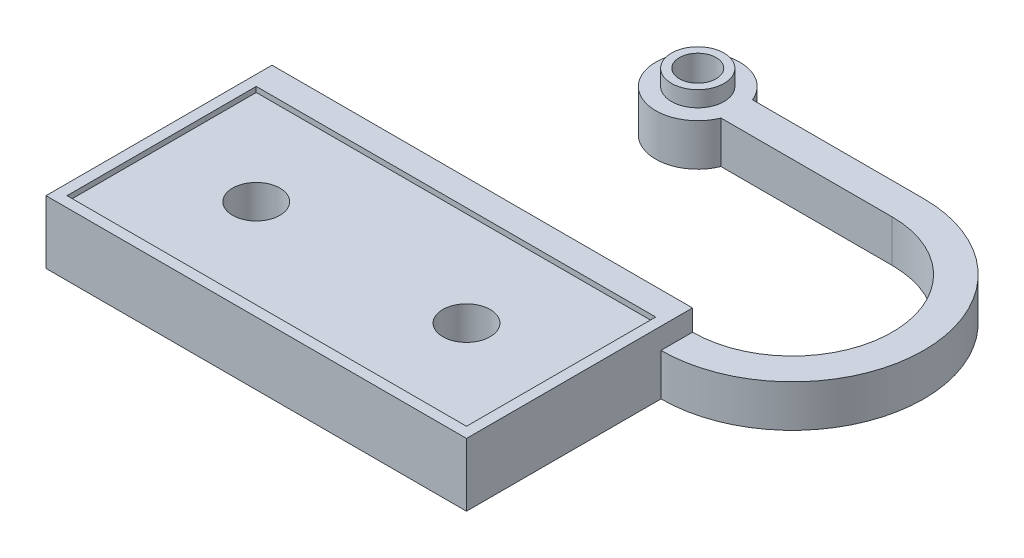
ISO-10303-21;
HEADER;
FILE_DESCRIPTION(('STEP AP214'),'2;1');
FILE_NAME('part.step','',(''),(''),'','','');
FILE_SCHEMA(('AUTOMOTIVE_DESIGN { 1 0 10303 214 1 1 1 1 }'));
ENDSEC;
DATA;
#1=APPLICATION_CONTEXT('core data for automotive mechanical design processes');
#2=APPLICATION_PROTOCOL_DEFINITION('international standard','automotive_design',2000,#1);
#3=PRODUCT_CONTEXT('',#1,'mechanical');
#4=PRODUCT('Part','Part','',(#3));
#5=PRODUCT_RELATED_PRODUCT_CATEGORY('part','',(#4));
#6=PRODUCT_DEFINITION_FORMATION('','',#4);
#7=PRODUCT_DEFINITION_CONTEXT('part definition',#1,'design');
#8=PRODUCT_DEFINITION('design','',#6,#7);
#9=PRODUCT_DEFINITION_SHAPE('','',#8);
#10=(LENGTH_UNIT() NAMED_UNIT(*) SI_UNIT(.MILLI.,.METRE.));
#11=(NAMED_UNIT(*) PLANE_ANGLE_UNIT() SI_UNIT($,.RADIAN.));
#12=(NAMED_UNIT(*) SI_UNIT($,.STERADIAN.) SOLID_ANGLE_UNIT());
#13=UNCERTAINTY_MEASURE_WITH_UNIT(LENGTH_MEASURE(1.E-05),#10,'distance_accuracy_value','');
#14=(GEOMETRIC_REPRESENTATION_CONTEXT(3) GLOBAL_UNCERTAINTY_ASSIGNED_CONTEXT((#13)) GLOBAL_UNIT_ASSIGNED_CONTEXT((#10,
#11,#12)) REPRESENTATION_CONTEXT('',''));
#15=CARTESIAN_POINT('',(0.,0.,0.));
#16=DIRECTION('',(0.,0.,1.));
#17=DIRECTION('',(1.,0.,0.));
#18=AXIS2_PLACEMENT_3D('',#15,#16,#17);
#19=CARTESIAN_POINT('',(-10.,6.,0.));
#20=DIRECTION('',(0.,-1.,0.));
#21=DIRECTION('',(0.,0.,-1.));
#22=AXIS2_PLACEMENT_3D('',#19,#20,#21);
#23=CYLINDRICAL_SURFACE('',#22,2.25);
#24=CARTESIAN_POINT('',(-10.,0.,0.));
#25=DIRECTION('',(0.,1.,0.));
#26=DIRECTION('',(0.,0.,1.));
#27=AXIS2_PLACEMENT_3D('',#24,#25,#26);
#28=CIRCLE('',#27,2.25);
#29=CARTESIAN_POINT('',(-10.,0.,2.25));
#30=VERTEX_POINT('',#29);
#31=EDGE_CURVE('E252',#30,#30,#28,.T.);
#32=ORIENTED_EDGE('',*,*,#31,.F.);
#33=EDGE_LOOP('',(#32));
#34=FACE_BOUND('',#33,.T.);
#35=CARTESIAN_POINT('',(-10.,5.5,0.));
#36=DIRECTION('',(0.,1.,0.));
#37=DIRECTION('',(0.,0.,1.));
#38=AXIS2_PLACEMENT_3D('',#35,#36,#37);
#39=CIRCLE('',#38,2.25);
#40=CARTESIAN_POINT('',(-10.,5.5,2.25));
#41=VERTEX_POINT('',#40);
#42=EDGE_CURVE('E173',#41,#41,#39,.T.);
#43=ORIENTED_EDGE('',*,*,#42,.T.);
#44=EDGE_LOOP('',(#43));
#45=FACE_BOUND('',#44,.T.);
#46=ADVANCED_FACE('F35',(#34,#45),#23,.F.);
#47=CARTESIAN_POINT('',(10.,6.,0.));
#48=DIRECTION('',(0.,-1.,0.));
#49=DIRECTION('',(0.,0.,-1.));
#50=AXIS2_PLACEMENT_3D('',#47,#48,#49);
#51=CYLINDRICAL_SURFACE('',#50,2.25);
#52=CARTESIAN_POINT('',(10.,0.,0.));
#53=DIRECTION('',(0.,1.,0.));
#54=DIRECTION('',(0.,0.,1.));
#55=AXIS2_PLACEMENT_3D('',#52,#53,#54);
#56=CIRCLE('',#55,2.25);
#57=CARTESIAN_POINT('',(10.,0.,2.25));
#58=VERTEX_POINT('',#57);
#59=EDGE_CURVE('E235',#58,#58,#56,.F.);
#60=ORIENTED_EDGE('',*,*,#59,.T.);
#61=EDGE_LOOP('',(#60));
#62=FACE_BOUND('',#61,.T.);
#63=CARTESIAN_POINT('',(10.,5.5,0.));
#64=DIRECTION('',(0.,1.,0.));
#65=DIRECTION('',(0.,0.,1.));
#66=AXIS2_PLACEMENT_3D('',#63,#64,#65);
#67=CIRCLE('',#66,2.25);
#68=CARTESIAN_POINT('',(10.,5.5,2.25));
#69=VERTEX_POINT('',#68);
#70=EDGE_CURVE('E39',#69,#69,#67,.F.);
#71=ORIENTED_EDGE('',*,*,#70,.F.);
#72=EDGE_LOOP('',(#71));
#73=FACE_BOUND('',#72,.T.);
#74=ADVANCED_FACE('F310',(#62,#73),#51,.F.);
#75=CARTESIAN_POINT('',(0.,4.,0.));
#76=DIRECTION('',(0.,1.,0.));
#77=DIRECTION('',(0.,0.,1.));
#78=AXIS2_PLACEMENT_3D('',#75,#76,#77);
#79=PLANE('',#78);
#80=CARTESIAN_POINT('',(20.,4.,-21.));
#81=DIRECTION('',(0.,1.,0.));
#82=DIRECTION('',(0.,0.,1.));
#83=AXIS2_PLACEMENT_3D('',#80,#81,#82);
#84=CIRCLE('',#83,12.5);
#85=CARTESIAN_POINT('',(20.,4.,-33.5));
#86=VERTEX_POINT('',#85);
#87=CARTESIAN_POINT('',(20.,4.,-8.5));
#88=VERTEX_POINT('',#87);
#89=EDGE_CURVE('E185',#86,#88,#84,.F.);
#90=ORIENTED_EDGE('',*,*,#89,.F.);
#91=DIRECTION('',(1.,0.,0.));
#92=VECTOR('',#91,1.);
#93=CARTESIAN_POINT('',(0.,4.,-33.5));
#94=LINE('',#93,#92);
#95=CARTESIAN_POINT('',(3.70809924354784,4.,-33.5));
#96=VERTEX_POINT('',#95);
#97=EDGE_CURVE('E188',#96,#86,#94,.T.);
#98=ORIENTED_EDGE('',*,*,#97,.F.);
#99=CARTESIAN_POINT('',(0.,4.,-32.));
#100=DIRECTION('',(0.,1.,0.));
#101=DIRECTION('',(0.,0.,1.));
#102=AXIS2_PLACEMENT_3D('',#99,#100,#101);
#103=CIRCLE('',#102,4.);
#104=CARTESIAN_POINT('',(3.70809924354783,4.,-30.5));
#105=VERTEX_POINT('',#104);
#106=EDGE_CURVE('E192',#105,#96,#103,.F.);
#107=ORIENTED_EDGE('',*,*,#106,.F.);
#108=DIRECTION('',(-1.,0.,0.));
#109=VECTOR('',#108,1.);
#110=CARTESIAN_POINT('',(0.,4.,-30.5));
#111=LINE('',#110,#109);
#112=CARTESIAN_POINT('',(20.,4.,-30.5));
#113=VERTEX_POINT('',#112);
#114=EDGE_CURVE('E195',#113,#105,#111,.T.);
#115=ORIENTED_EDGE('',*,*,#114,.F.);
#116=CARTESIAN_POINT('',(20.,4.,-21.));
#117=DIRECTION('',(0.,1.,0.));
#118=DIRECTION('',(0.,0.,1.));
#119=AXIS2_PLACEMENT_3D('',#116,#117,#118);
#120=CIRCLE('',#119,9.49999999999999);
#121=CARTESIAN_POINT('',(20.,4.,-11.5));
#122=VERTEX_POINT('',#121);
#123=EDGE_CURVE('E198',#122,#113,#120,.T.);
#124=ORIENTED_EDGE('',*,*,#123,.F.);
#125=DIRECTION('',(0.,0.,1.));
#126=VECTOR('',#125,1.);
#127=CARTESIAN_POINT('',(20.,4.,0.));
#128=LINE('',#127,#126);
#129=EDGE_CURVE('E201',#122,#88,#128,.T.);
#130=ORIENTED_EDGE('',*,*,#129,.T.);
#131=EDGE_LOOP('',(#90,#98,#107,#115,#124,#130));
#132=FACE_BOUND('',#131,.T.);
#133=CARTESIAN_POINT('',(0.,4.,-32.));
#134=DIRECTION('',(0.,1.,0.));
#135=DIRECTION('',(0.,0.,1.));
#136=AXIS2_PLACEMENT_3D('',#133,#134,#135);
#137=CIRCLE('',#136,2.5);
#138=CARTESIAN_POINT('',(0.,4.,-29.5));
#139=VERTEX_POINT('',#138);
#140=EDGE_CURVE('E179',#139,#139,#137,.T.);
#141=ORIENTED_EDGE('',*,*,#140,.F.);
#142=EDGE_LOOP('',(#141));
#143=FACE_BOUND('',#142,.T.);
#144=ADVANCED_FACE('F281',(#132,#143),#79,.T.);
#145=CARTESIAN_POINT('',(20.,6.,0.));
#146=DIRECTION('',(1.,0.,0.));
#147=DIRECTION('',(0.,0.,-1.));
#148=AXIS2_PLACEMENT_3D('',#145,#146,#147);
#149=PLANE('',#148);
#150=DIRECTION('',(0.,-1.,0.));
#151=VECTOR('',#150,1.);
#152=CARTESIAN_POINT('',(20.,4.,-8.5));
#153=LINE('',#152,#151);
#154=CARTESIAN_POINT('',(20.,0.,-8.5));
#155=VERTEX_POINT('',#154);
#156=EDGE_CURVE('E203',#88,#155,#153,.T.);
#157=ORIENTED_EDGE('',*,*,#156,.F.);
#158=ORIENTED_EDGE('',*,*,#129,.F.);
#159=DIRECTION('',(0.,-1.,0.));
#160=VECTOR('',#159,1.);
#161=CARTESIAN_POINT('',(20.,6.,-11.5));
#162=LINE('',#161,#160);
#163=CARTESIAN_POINT('',(20.,6.,-11.5));
#164=VERTEX_POINT('',#163);
#165=EDGE_CURVE('E11',#164,#122,#162,.T.);
#166=ORIENTED_EDGE('',*,*,#165,.F.);
#167=DIRECTION('',(0.,0.,1.));
#168=VECTOR('',#167,1.);
#169=CARTESIAN_POINT('',(20.,6.,0.));
#170=LINE('',#169,#168);
#171=CARTESIAN_POINT('',(20.,6.,10.));
#172=VERTEX_POINT('',#171);
#173=EDGE_CURVE('E231',#164,#172,#170,.T.);
#174=ORIENTED_EDGE('',*,*,#173,.T.);
#175=DIRECTION('',(0.,-1.,0.));
#176=VECTOR('',#175,1.);
#177=CARTESIAN_POINT('',(20.,6.,10.));
#178=LINE('',#177,#176);
#179=CARTESIAN_POINT('',(20.,0.,10.));
#180=VERTEX_POINT('',#179);
#181=EDGE_CURVE('E242',#172,#180,#178,.T.);
#182=ORIENTED_EDGE('',*,*,#181,.T.);
#183=DIRECTION('',(0.,0.,1.));
#184=VECTOR('',#183,1.);
#185=CARTESIAN_POINT('',(20.,0.,0.));
#186=LINE('',#185,#184);
#187=EDGE_CURVE('E230',#155,#180,#186,.T.);
#188=ORIENTED_EDGE('',*,*,#187,.F.);
#189=EDGE_LOOP('',(#157,#158,#166,#174,#182,#188));
#190=FACE_BOUND('',#189,.T.);
#191=ADVANCED_FACE('F37',(#190),#149,.T.);
#192=CARTESIAN_POINT('',(0.,6.,-11.5));
#193=DIRECTION('',(0.,0.,-1.));
#194=DIRECTION('',(-1.,0.,0.));
#195=AXIS2_PLACEMENT_3D('',#192,#193,#194);
#196=PLANE('',#195);
#197=DIRECTION('',(1.,0.,0.));
#198=VECTOR('',#197,1.);
#199=CARTESIAN_POINT('',(0.,0.,-11.5));
#200=LINE('',#199,#198);
#201=CARTESIAN_POINT('',(-19.9999999999999,0.,-11.5));
#202=VERTEX_POINT('',#201);
#203=CARTESIAN_POINT('',(20.,0.,-11.5));
#204=VERTEX_POINT('',#203);
#205=EDGE_CURVE('E244',#202,#204,#200,.T.);
#206=ORIENTED_EDGE('',*,*,#205,.F.);
#207=DIRECTION('',(0.,-1.,0.));
#208=VECTOR('',#207,1.);
#209=CARTESIAN_POINT('',(-19.9999999999999,6.,-11.5));
#210=LINE('',#209,#208);
#211=CARTESIAN_POINT('',(-19.9999999999999,6.,-11.5));
#212=VERTEX_POINT('',#211);
#213=EDGE_CURVE('E44',#212,#202,#210,.T.);
#214=ORIENTED_EDGE('',*,*,#213,.F.);
#215=DIRECTION('',(1.,0.,0.));
#216=VECTOR('',#215,1.);
#217=CARTESIAN_POINT('',(0.,6.,-11.5));
#218=LINE('',#217,#216);
#219=EDGE_CURVE('E234',#212,#164,#218,.T.);
#220=ORIENTED_EDGE('',*,*,#219,.T.);
#221=ORIENTED_EDGE('',*,*,#165,.T.);
#222=DIRECTION('',(0.,-1.,0.));
#223=VECTOR('',#222,1.);
#224=CARTESIAN_POINT('',(20.,4.,-11.5));
#225=LINE('',#224,#223);
#226=EDGE_CURVE('E219',#122,#204,#225,.T.);
#227=ORIENTED_EDGE('',*,*,#226,.T.);
#228=EDGE_LOOP('',(#206,#214,#220,#221,#227));
#229=FACE_BOUND('',#228,.T.);
#230=ADVANCED_FACE('F273',(#229),#196,.T.);
#231=CARTESIAN_POINT('',(-20.0000000000001,6.,2.98372437868013E-13));
#232=DIRECTION('',(1.,0.,0.));
#233=DIRECTION('',(0.,0.,-1.));
#234=AXIS2_PLACEMENT_3D('',#231,#232,#233);
#235=PLANE('',#234);
#236=DIRECTION('',(0.,0.,1.));
#237=VECTOR('',#236,1.);
#238=CARTESIAN_POINT('',(-20.0000000000001,0.,2.98372437868013E-13));
#239=LINE('',#238,#237);
#240=CARTESIAN_POINT('',(-20.,0.,10.));
#241=VERTEX_POINT('',#240);
#242=EDGE_CURVE('E247',#202,#241,#239,.T.);
#243=ORIENTED_EDGE('',*,*,#242,.T.);
#244=DIRECTION('',(0.,-1.,0.));
#245=VECTOR('',#244,1.);
#246=CARTESIAN_POINT('',(-20.,6.,10.));
#247=LINE('',#246,#245);
#248=CARTESIAN_POINT('',(-20.,6.,10.));
#249=VERTEX_POINT('',#248);
#250=EDGE_CURVE('E259',#249,#241,#247,.T.);
#251=ORIENTED_EDGE('',*,*,#250,.F.);
#252=DIRECTION('',(0.,0.,1.));
#253=VECTOR('',#252,1.);
#254=CARTESIAN_POINT('',(-20.0000000000001,6.,2.98372437868013E-13));
#255=LINE('',#254,#253);
#256=EDGE_CURVE('E238',#212,#249,#255,.T.);
#257=ORIENTED_EDGE('',*,*,#256,.F.);
#258=ORIENTED_EDGE('',*,*,#213,.T.);
#259=EDGE_LOOP('',(#243,#251,#257,#258));
#260=FACE_BOUND('',#259,.T.);
#261=ADVANCED_FACE('F265',(#260),#235,.F.);
#262=CARTESIAN_POINT('',(0.,6.,10.));
#263=DIRECTION('',(0.,0.,-1.));
#264=DIRECTION('',(-1.,0.,0.));
#265=AXIS2_PLACEMENT_3D('',#262,#263,#264);
#266=PLANE('',#265);
#267=DIRECTION('',(1.,0.,0.));
#268=VECTOR('',#267,1.);
#269=CARTESIAN_POINT('',(0.,0.,10.));
#270=LINE('',#269,#268);
#271=EDGE_CURVE('E249',#241,#180,#270,.T.);
#272=ORIENTED_EDGE('',*,*,#271,.T.);
#273=ORIENTED_EDGE('',*,*,#181,.F.);
#274=DIRECTION('',(1.,0.,0.));
#275=VECTOR('',#274,1.);
#276=CARTESIAN_POINT('',(0.,6.,10.));
#277=LINE('',#276,#275);
#278=EDGE_CURVE('E240',#249,#172,#277,.T.);
#279=ORIENTED_EDGE('',*,*,#278,.F.);
#280=ORIENTED_EDGE('',*,*,#250,.T.);
#281=EDGE_LOOP('',(#272,#273,#279,#280));
#282=FACE_BOUND('',#281,.T.);
#283=ADVANCED_FACE('F322',(#282),#266,.F.);
#284=CARTESIAN_POINT('',(0.,6.,0.));
#285=DIRECTION('',(0.,1.,0.));
#286=DIRECTION('',(0.,0.,1.));
#287=AXIS2_PLACEMENT_3D('',#284,#285,#286);
#288=PLANE('',#287);
#289=DIRECTION('',(0.,0.,1.));
#290=VECTOR('',#289,1.);
#291=CARTESIAN_POINT('',(-19.,6.,-9.));
#292=LINE('',#291,#290);
#293=CARTESIAN_POINT('',(-19.,6.,-9.));
#294=VERTEX_POINT('',#293);
#295=CARTESIAN_POINT('',(-19.,6.,9.));
#296=VERTEX_POINT('',#295);
#297=EDGE_CURVE('E51',#294,#296,#292,.T.);
#298=ORIENTED_EDGE('',*,*,#297,.F.);
#299=DIRECTION('',(1.,0.,0.));
#300=VECTOR('',#299,1.);
#301=CARTESIAN_POINT('',(-19.,6.,-9.));
#302=LINE('',#301,#300);
#303=CARTESIAN_POINT('',(19.,6.,-9.));
#304=VERTEX_POINT('',#303);
#305=EDGE_CURVE('E155',#294,#304,#302,.T.);
#306=ORIENTED_EDGE('',*,*,#305,.T.);
#307=DIRECTION('',(0.,0.,1.));
#308=VECTOR('',#307,1.);
#309=CARTESIAN_POINT('',(19.,6.,-9.));
#310=LINE('',#309,#308);
#311=CARTESIAN_POINT('',(19.,6.,9.));
#312=VERTEX_POINT('',#311);
#313=EDGE_CURVE('E158',#304,#312,#310,.T.);
#314=ORIENTED_EDGE('',*,*,#313,.T.);
#315=DIRECTION('',(1.,0.,0.));
#316=VECTOR('',#315,1.);
#317=CARTESIAN_POINT('',(-19.,6.,9.));
#318=LINE('',#317,#316);
#319=EDGE_CURVE('E164',#296,#312,#318,.T.);
#320=ORIENTED_EDGE('',*,*,#319,.F.);
#321=EDGE_LOOP('',(#298,#306,#314,#320));
#322=FACE_BOUND('',#321,.T.);
#323=ORIENTED_EDGE('',*,*,#173,.F.);
#324=ORIENTED_EDGE('',*,*,#219,.F.);
#325=ORIENTED_EDGE('',*,*,#256,.T.);
#326=ORIENTED_EDGE('',*,*,#278,.T.);
#327=EDGE_LOOP('',(#323,#324,#325,#326));
#328=FACE_BOUND('',#327,.T.);
#329=ADVANCED_FACE('F325',(#322,#328),#288,.T.);
#330=CARTESIAN_POINT('',(0.,0.,0.));
#331=DIRECTION('',(0.,1.,0.));
#332=DIRECTION('',(0.,0.,1.));
#333=AXIS2_PLACEMENT_3D('',#330,#331,#332);
#334=PLANE('',#333);
#335=ORIENTED_EDGE('',*,*,#205,.T.);
#336=CARTESIAN_POINT('',(20.,0.,-21.));
#337=DIRECTION('',(0.,1.,0.));
#338=DIRECTION('',(0.,0.,1.));
#339=AXIS2_PLACEMENT_3D('',#336,#337,#338);
#340=CIRCLE('',#339,9.49999999999999);
#341=CARTESIAN_POINT('',(20.,0.,-30.5));
#342=VERTEX_POINT('',#341);
#343=EDGE_CURVE('E213',#204,#342,#340,.T.);
#344=ORIENTED_EDGE('',*,*,#343,.T.);
#345=DIRECTION('',(-1.,0.,0.));
#346=VECTOR('',#345,1.);
#347=CARTESIAN_POINT('',(0.,0.,-30.5));
#348=LINE('',#347,#346);
#349=CARTESIAN_POINT('',(3.70809924354783,0.,-30.5));
#350=VERTEX_POINT('',#349);
#351=EDGE_CURVE('E210',#342,#350,#348,.T.);
#352=ORIENTED_EDGE('',*,*,#351,.T.);
#353=CARTESIAN_POINT('',(0.,0.,-32.));
#354=DIRECTION('',(0.,1.,0.));
#355=DIRECTION('',(0.,0.,1.));
#356=AXIS2_PLACEMENT_3D('',#353,#354,#355);
#357=CIRCLE('',#356,4.);
#358=CARTESIAN_POINT('',(3.70809924354784,0.,-33.5));
#359=VERTEX_POINT('',#358);
#360=EDGE_CURVE('E207',#350,#359,#357,.F.);
#361=ORIENTED_EDGE('',*,*,#360,.T.);
#362=DIRECTION('',(1.,0.,0.));
#363=VECTOR('',#362,1.);
#364=CARTESIAN_POINT('',(0.,0.,-33.5));
#365=LINE('',#364,#363);
#366=CARTESIAN_POINT('',(20.,0.,-33.5));
#367=VERTEX_POINT('',#366);
#368=EDGE_CURVE('E205',#359,#367,#365,.T.);
#369=ORIENTED_EDGE('',*,*,#368,.T.);
#370=CARTESIAN_POINT('',(20.,0.,-21.));
#371=DIRECTION('',(0.,1.,0.));
#372=DIRECTION('',(0.,0.,1.));
#373=AXIS2_PLACEMENT_3D('',#370,#371,#372);
#374=CIRCLE('',#373,12.5);
#375=EDGE_CURVE('E59',#367,#155,#374,.F.);
#376=ORIENTED_EDGE('',*,*,#375,.T.);
#377=ORIENTED_EDGE('',*,*,#187,.T.);
#378=ORIENTED_EDGE('',*,*,#271,.F.);
#379=ORIENTED_EDGE('',*,*,#242,.F.);
#380=EDGE_LOOP('',(#335,#344,#352,#361,#369,#376,#377,#378,#379));
#381=FACE_BOUND('',#380,.T.);
#382=ORIENTED_EDGE('',*,*,#31,.T.);
#383=EDGE_LOOP('',(#382));
#384=FACE_BOUND('',#383,.T.);
#385=ORIENTED_EDGE('',*,*,#59,.F.);
#386=EDGE_LOOP('',(#385));
#387=FACE_BOUND('',#386,.T.);
#388=CARTESIAN_POINT('',(0.,0.,-32.));
#389=DIRECTION('',(0.,1.,0.));
#390=DIRECTION('',(0.,0.,1.));
#391=AXIS2_PLACEMENT_3D('',#388,#389,#390);
#392=CIRCLE('',#391,1.75);
#393=CARTESIAN_POINT('',(0.,0.,-30.25));
#394=VERTEX_POINT('',#393);
#395=EDGE_CURVE('E189',#394,#394,#392,.T.);
#396=ORIENTED_EDGE('',*,*,#395,.T.);
#397=EDGE_LOOP('',(#396));
#398=FACE_BOUND('',#397,.T.);
#399=ADVANCED_FACE('F271',(#381,#384,#387,#398),#334,.F.);
#400=CARTESIAN_POINT('',(20.,4.,-21.));
#401=DIRECTION('',(0.,-1.,0.));
#402=DIRECTION('',(0.,0.,-1.));
#403=AXIS2_PLACEMENT_3D('',#400,#401,#402);
#404=CYLINDRICAL_SURFACE('',#403,12.5);
#405=ORIENTED_EDGE('',*,*,#375,.F.);
#406=DIRECTION('',(0.,-1.,0.));
#407=VECTOR('',#406,1.);
#408=CARTESIAN_POINT('',(20.,4.,-33.5));
#409=LINE('',#408,#407);
#410=EDGE_CURVE('E228',#86,#367,#409,.T.);
#411=ORIENTED_EDGE('',*,*,#410,.F.);
#412=ORIENTED_EDGE('',*,*,#89,.T.);
#413=ORIENTED_EDGE('',*,*,#156,.T.);
#414=EDGE_LOOP('',(#405,#411,#412,#413));
#415=FACE_BOUND('',#414,.T.);
#416=ADVANCED_FACE('F289',(#415),#404,.T.);
#417=CARTESIAN_POINT('',(0.,4.,-33.5));
#418=DIRECTION('',(0.,0.,-1.));
#419=DIRECTION('',(-1.,0.,0.));
#420=AXIS2_PLACEMENT_3D('',#417,#418,#419);
#421=PLANE('',#420);
#422=ORIENTED_EDGE('',*,*,#368,.F.);
#423=DIRECTION('',(0.,-1.,0.));
#424=VECTOR('',#423,1.);
#425=CARTESIAN_POINT('',(3.70809924354784,4.,-33.5));
#426=LINE('',#425,#424);
#427=EDGE_CURVE('E226',#96,#359,#426,.T.);
#428=ORIENTED_EDGE('',*,*,#427,.F.);
#429=ORIENTED_EDGE('',*,*,#97,.T.);
#430=ORIENTED_EDGE('',*,*,#410,.T.);
#431=EDGE_LOOP('',(#422,#428,#429,#430));
#432=FACE_BOUND('',#431,.T.);
#433=ADVANCED_FACE('F293',(#432),#421,.T.);
#434=CARTESIAN_POINT('',(0.,4.,-32.));
#435=DIRECTION('',(0.,-1.,0.));
#436=DIRECTION('',(0.,0.,-1.));
#437=AXIS2_PLACEMENT_3D('',#434,#435,#436);
#438=CYLINDRICAL_SURFACE('',#437,4.);
#439=ORIENTED_EDGE('',*,*,#360,.F.);
#440=DIRECTION('',(0.,-1.,0.));
#441=VECTOR('',#440,1.);
#442=CARTESIAN_POINT('',(3.70809924354783,4.,-30.5));
#443=LINE('',#442,#441);
#444=EDGE_CURVE('E224',#105,#350,#443,.T.);
#445=ORIENTED_EDGE('',*,*,#444,.F.);
#446=ORIENTED_EDGE('',*,*,#106,.T.);
#447=ORIENTED_EDGE('',*,*,#427,.T.);
#448=EDGE_LOOP('',(#439,#445,#446,#447));
#449=FACE_BOUND('',#448,.T.);
#450=ADVANCED_FACE('F296',(#449),#438,.T.);
#451=CARTESIAN_POINT('',(0.,4.,-30.5));
#452=DIRECTION('',(0.,0.,1.));
#453=DIRECTION('',(1.,0.,0.));
#454=AXIS2_PLACEMENT_3D('',#451,#452,#453);
#455=PLANE('',#454);
#456=ORIENTED_EDGE('',*,*,#351,.F.);
#457=DIRECTION('',(0.,-1.,0.));
#458=VECTOR('',#457,1.);
#459=CARTESIAN_POINT('',(20.,4.,-30.5));
#460=LINE('',#459,#458);
#461=EDGE_CURVE('E222',#113,#342,#460,.T.);
#462=ORIENTED_EDGE('',*,*,#461,.F.);
#463=ORIENTED_EDGE('',*,*,#114,.T.);
#464=ORIENTED_EDGE('',*,*,#444,.T.);
#465=EDGE_LOOP('',(#456,#462,#463,#464));
#466=FACE_BOUND('',#465,.T.);
#467=ADVANCED_FACE('F299',(#466),#455,.T.);
#468=CARTESIAN_POINT('',(20.,4.,-21.));
#469=DIRECTION('',(0.,-1.,0.));
#470=DIRECTION('',(0.,0.,-1.));
#471=AXIS2_PLACEMENT_3D('',#468,#469,#470);
#472=CYLINDRICAL_SURFACE('',#471,9.49999999999999);
#473=ORIENTED_EDGE('',*,*,#343,.F.);
#474=ORIENTED_EDGE('',*,*,#226,.F.);
#475=ORIENTED_EDGE('',*,*,#123,.T.);
#476=ORIENTED_EDGE('',*,*,#461,.T.);
#477=EDGE_LOOP('',(#473,#474,#475,#476));
#478=FACE_BOUND('',#477,.T.);
#479=ADVANCED_FACE('F276',(#478),#472,.F.);
#480=CARTESIAN_POINT('',(0.,4.,-32.));
#481=DIRECTION('',(0.,-1.,0.));
#482=DIRECTION('',(0.,0.,-1.));
#483=AXIS2_PLACEMENT_3D('',#480,#481,#482);
#484=CYLINDRICAL_SURFACE('',#483,1.75);
#485=ORIENTED_EDGE('',*,*,#395,.F.);
#486=EDGE_LOOP('',(#485));
#487=FACE_BOUND('',#486,.T.);
#488=CARTESIAN_POINT('',(0.,5.5,-32.));
#489=DIRECTION('',(0.,1.,0.));
#490=DIRECTION('',(0.,0.,1.));
#491=AXIS2_PLACEMENT_3D('',#488,#489,#490);
#492=CIRCLE('',#491,1.75);
#493=CARTESIAN_POINT('',(0.,5.5,-30.25));
#494=VERTEX_POINT('',#493);
#495=EDGE_CURVE('E176',#494,#494,#492,.T.);
#496=ORIENTED_EDGE('',*,*,#495,.T.);
#497=EDGE_LOOP('',(#496));
#498=FACE_BOUND('',#497,.T.);
#499=ADVANCED_FACE('F306',(#487,#498),#484,.F.);
#500=CARTESIAN_POINT('',(0.,5.5,-32.));
#501=DIRECTION('',(0.,1.,0.));
#502=DIRECTION('',(0.,0.,1.));
#503=AXIS2_PLACEMENT_3D('',#500,#501,#502);
#504=PLANE('',#503);
#505=CARTESIAN_POINT('',(0.,5.5,-32.));
#506=DIRECTION('',(0.,1.,0.));
#507=DIRECTION('',(0.,0.,1.));
#508=AXIS2_PLACEMENT_3D('',#505,#506,#507);
#509=CIRCLE('',#508,2.5);
#510=CARTESIAN_POINT('',(0.,5.5,-29.5));
#511=VERTEX_POINT('',#510);
#512=EDGE_CURVE('E180',#511,#511,#509,.T.);
#513=ORIENTED_EDGE('',*,*,#512,.T.);
#514=EDGE_LOOP('',(#513));
#515=FACE_BOUND('',#514,.T.);
#516=ORIENTED_EDGE('',*,*,#495,.F.);
#517=EDGE_LOOP('',(#516));
#518=FACE_BOUND('',#517,.T.);
#519=ADVANCED_FACE('F343',(#515,#518),#504,.T.);
#520=CARTESIAN_POINT('',(0.,5.5,-32.));
#521=DIRECTION('',(0.,-1.,0.));
#522=DIRECTION('',(0.,0.,-1.));
#523=AXIS2_PLACEMENT_3D('',#520,#521,#522);
#524=CYLINDRICAL_SURFACE('',#523,2.5);
#525=ORIENTED_EDGE('',*,*,#512,.F.);
#526=EDGE_LOOP('',(#525));
#527=FACE_BOUND('',#526,.T.);
#528=ORIENTED_EDGE('',*,*,#140,.T.);
#529=EDGE_LOOP('',(#528));
#530=FACE_BOUND('',#529,.T.);
#531=ADVANCED_FACE('F340',(#527,#530),#524,.T.);
#532=CARTESIAN_POINT('',(0.,5.5,0.));
#533=DIRECTION('',(0.,1.,0.));
#534=DIRECTION('',(0.,0.,1.));
#535=AXIS2_PLACEMENT_3D('',#532,#533,#534);
#536=PLANE('',#535);
#537=ORIENTED_EDGE('',*,*,#42,.F.);
#538=EDGE_LOOP('',(#537));
#539=FACE_BOUND('',#538,.T.);
#540=DIRECTION('',(0.,0.,1.));
#541=VECTOR('',#540,1.);
#542=CARTESIAN_POINT('',(-19.,5.5,-9.));
#543=LINE('',#542,#541);
#544=CARTESIAN_POINT('',(-19.,5.5,-9.));
#545=VERTEX_POINT('',#544);
#546=CARTESIAN_POINT('',(-19.,5.5,9.));
#547=VERTEX_POINT('',#546);
#548=EDGE_CURVE('E137',#545,#547,#543,.T.);
#549=ORIENTED_EDGE('',*,*,#548,.T.);
#550=DIRECTION('',(1.,0.,0.));
#551=VECTOR('',#550,1.);
#552=CARTESIAN_POINT('',(-19.,5.5,9.));
#553=LINE('',#552,#551);
#554=CARTESIAN_POINT('',(19.,5.5,9.));
#555=VERTEX_POINT('',#554);
#556=EDGE_CURVE('E146',#547,#555,#553,.T.);
#557=ORIENTED_EDGE('',*,*,#556,.T.);
#558=DIRECTION('',(0.,0.,1.));
#559=VECTOR('',#558,1.);
#560=CARTESIAN_POINT('',(19.,5.5,-9.));
#561=LINE('',#560,#559);
#562=CARTESIAN_POINT('',(19.,5.5,-9.));
#563=VERTEX_POINT('',#562);
#564=EDGE_CURVE('E150',#563,#555,#561,.T.);
#565=ORIENTED_EDGE('',*,*,#564,.F.);
#566=DIRECTION('',(1.,0.,0.));
#567=VECTOR('',#566,1.);
#568=CARTESIAN_POINT('',(-19.,5.5,-9.));
#569=LINE('',#568,#567);
#570=EDGE_CURVE('E142',#545,#563,#569,.T.);
#571=ORIENTED_EDGE('',*,*,#570,.F.);
#572=EDGE_LOOP('',(#549,#557,#565,#571));
#573=FACE_BOUND('',#572,.T.);
#574=ORIENTED_EDGE('',*,*,#70,.T.);
#575=EDGE_LOOP('',(#574));
#576=FACE_BOUND('',#575,.T.);
#577=ADVANCED_FACE('F153',(#539,#573,#576),#536,.T.);
#578=CARTESIAN_POINT('',(-19.,5.5,-9.));
#579=DIRECTION('',(-1.,0.,0.));
#580=DIRECTION('',(0.,0.,1.));
#581=AXIS2_PLACEMENT_3D('',#578,#579,#580);
#582=PLANE('',#581);
#583=ORIENTED_EDGE('',*,*,#297,.T.);
#584=DIRECTION('',(0.,1.,0.));
#585=VECTOR('',#584,1.);
#586=CARTESIAN_POINT('',(-19.,5.5,9.));
#587=LINE('',#586,#585);
#588=EDGE_CURVE('E133',#547,#296,#587,.T.);
#589=ORIENTED_EDGE('',*,*,#588,.F.);
#590=ORIENTED_EDGE('',*,*,#548,.F.);
#591=DIRECTION('',(0.,1.,0.));
#592=VECTOR('',#591,1.);
#593=CARTESIAN_POINT('',(-19.,5.5,-9.));
#594=LINE('',#593,#592);
#595=EDGE_CURVE('E168',#545,#294,#594,.T.);
#596=ORIENTED_EDGE('',*,*,#595,.T.);
#597=EDGE_LOOP('',(#583,#589,#590,#596));
#598=FACE_BOUND('',#597,.T.);
#599=ADVANCED_FACE('F135',(#598),#582,.F.);
#600=CARTESIAN_POINT('',(-19.,5.5,-9.));
#601=DIRECTION('',(0.,0.,1.));
#602=DIRECTION('',(1.,0.,0.));
#603=AXIS2_PLACEMENT_3D('',#600,#601,#602);
#604=PLANE('',#603);
#605=ORIENTED_EDGE('',*,*,#305,.F.);
#606=ORIENTED_EDGE('',*,*,#595,.F.);
#607=ORIENTED_EDGE('',*,*,#570,.T.);
#608=DIRECTION('',(0.,1.,0.));
#609=VECTOR('',#608,1.);
#610=CARTESIAN_POINT('',(19.,5.5,-9.));
#611=LINE('',#610,#609);
#612=EDGE_CURVE('E170',#563,#304,#611,.T.);
#613=ORIENTED_EDGE('',*,*,#612,.T.);
#614=EDGE_LOOP('',(#605,#606,#607,#613));
#615=FACE_BOUND('',#614,.T.);
#616=ADVANCED_FACE('F441',(#615),#604,.T.);
#617=CARTESIAN_POINT('',(19.,5.5,-9.));
#618=DIRECTION('',(-1.,0.,0.));
#619=DIRECTION('',(0.,0.,1.));
#620=AXIS2_PLACEMENT_3D('',#617,#618,#619);
#621=PLANE('',#620);
#622=ORIENTED_EDGE('',*,*,#313,.F.);
#623=ORIENTED_EDGE('',*,*,#612,.F.);
#624=ORIENTED_EDGE('',*,*,#564,.T.);
#625=DIRECTION('',(0.,1.,0.));
#626=VECTOR('',#625,1.);
#627=CARTESIAN_POINT('',(19.,5.5,9.));
#628=LINE('',#627,#626);
#629=EDGE_CURVE('E141',#555,#312,#628,.T.);
#630=ORIENTED_EDGE('',*,*,#629,.T.);
#631=EDGE_LOOP('',(#622,#623,#624,#630));
#632=FACE_BOUND('',#631,.T.);
#633=ADVANCED_FACE('F450',(#632),#621,.T.);
#634=CARTESIAN_POINT('',(-19.,5.5,9.));
#635=DIRECTION('',(0.,0.,1.));
#636=DIRECTION('',(1.,0.,0.));
#637=AXIS2_PLACEMENT_3D('',#634,#635,#636);
#638=PLANE('',#637);
#639=ORIENTED_EDGE('',*,*,#319,.T.);
#640=ORIENTED_EDGE('',*,*,#629,.F.);
#641=ORIENTED_EDGE('',*,*,#556,.F.);
#642=ORIENTED_EDGE('',*,*,#588,.T.);
#643=EDGE_LOOP('',(#639,#640,#641,#642));
#644=FACE_BOUND('',#643,.T.);
#645=ADVANCED_FACE('F147',(#644),#638,.F.);
#646=CLOSED_SHELL('',(#46,#74,#144,#191,#230,#261,#283,#329,#399,#416,#433,#450,#467,#479,#499,
#519,#531,#577,#599,#616,#633,#645));
#647=MANIFOLD_SOLID_BREP('B2',#646);
#648=ADVANCED_BREP_SHAPE_REPRESENTATION('',(#18,#647),#14);
#649=SHAPE_DEFINITION_REPRESENTATION(#9,#648);
ENDSEC;
END-ISO-10303-21;
